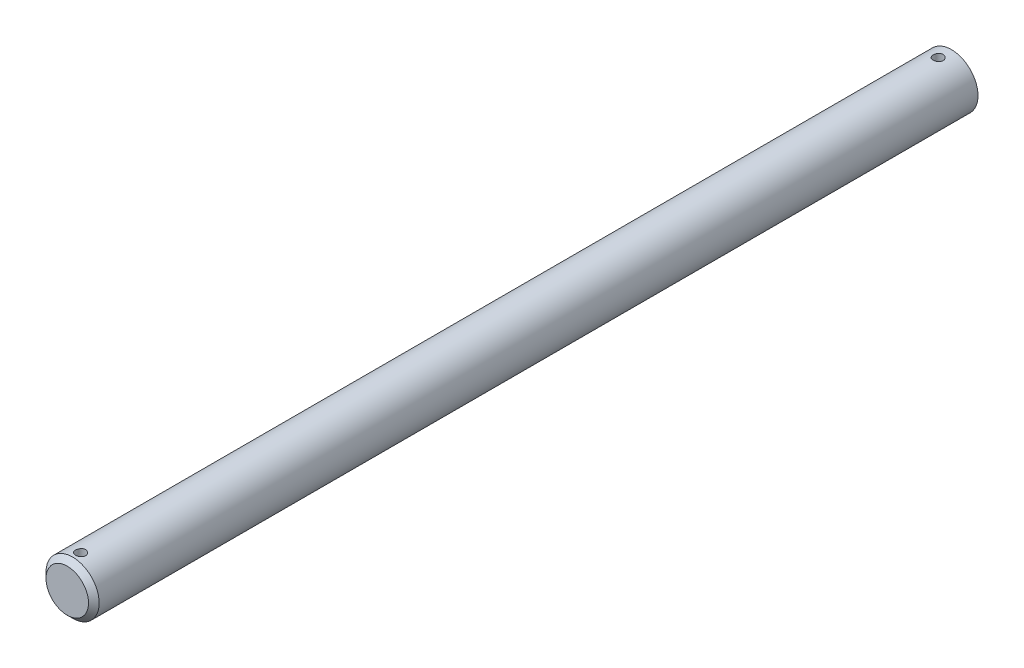
ISO-10303-21;
HEADER;
FILE_DESCRIPTION(('STEP AP214'),'2;1');
FILE_NAME('part.step','',(''),(''),'','','');
FILE_SCHEMA(('AUTOMOTIVE_DESIGN { 1 0 10303 214 1 1 1 1 }'));
ENDSEC;
DATA;
#1=APPLICATION_CONTEXT('core data for automotive mechanical design processes');
#2=APPLICATION_PROTOCOL_DEFINITION('international standard','automotive_design',2000,#1);
#3=PRODUCT_CONTEXT('',#1,'mechanical');
#4=PRODUCT('Part','Part','',(#3));
#5=PRODUCT_RELATED_PRODUCT_CATEGORY('part','',(#4));
#6=PRODUCT_DEFINITION_FORMATION('','',#4);
#7=PRODUCT_DEFINITION_CONTEXT('part definition',#1,'design');
#8=PRODUCT_DEFINITION('design','',#6,#7);
#9=PRODUCT_DEFINITION_SHAPE('','',#8);
#10=(LENGTH_UNIT() NAMED_UNIT(*) SI_UNIT(.MILLI.,.METRE.));
#11=(NAMED_UNIT(*) PLANE_ANGLE_UNIT() SI_UNIT($,.RADIAN.));
#12=(NAMED_UNIT(*) SI_UNIT($,.STERADIAN.) SOLID_ANGLE_UNIT());
#13=UNCERTAINTY_MEASURE_WITH_UNIT(LENGTH_MEASURE(1.E-05),#10,'distance_accuracy_value','');
#14=(GEOMETRIC_REPRESENTATION_CONTEXT(3) GLOBAL_UNCERTAINTY_ASSIGNED_CONTEXT((#13)) GLOBAL_UNIT_ASSIGNED_CONTEXT((#10,
#11,#12)) REPRESENTATION_CONTEXT('',''));
#15=CARTESIAN_POINT('',(0.,0.,0.));
#16=DIRECTION('',(0.,0.,1.));
#17=DIRECTION('',(1.,0.,0.));
#18=AXIS2_PLACEMENT_3D('',#15,#16,#17);
#19=CARTESIAN_POINT('',(0.,0.,304.8));
#20=DIRECTION('',(0.,0.,-1.));
#21=DIRECTION('',(-1.,0.,0.));
#22=AXIS2_PLACEMENT_3D('',#19,#20,#21);
#23=CYLINDRICAL_SURFACE('',#22,3.175);
#24=CARTESIAN_POINT('',(0.,-3.17500000000001,201.355762388));
#25=CARTESIAN_POINT('',(0.0331278493784846,-3.17499940005936,201.355761122132));
#26=CARTESIAN_POINT('',(0.0662721689897596,-3.17447616437681,201.352987804467));
#27=CARTESIAN_POINT('',(0.131626820280966,-3.17243930650301,201.341974952437));
#28=CARTESIAN_POINT('',(0.163836339741667,-3.17092484847488,201.333730804777));
#29=CARTESIAN_POINT('',(0.226366769234935,-3.16707495697542,201.312037597188));
#30=CARTESIAN_POINT('',(0.256689356240746,-3.16474026510011,201.298593237808));
#31=CARTESIAN_POINT('',(0.314645664321683,-3.1595048514429,201.266894583721));
#32=CARTESIAN_POINT('',(0.342279602808188,-3.1566041754851,201.248640678371));
#33=CARTESIAN_POINT('',(0.394407912259922,-3.15051811645857,201.207609042574));
#34=CARTESIAN_POINT('',(0.418865429028264,-3.14733001333615,201.184784889647));
#35=CARTESIAN_POINT('',(0.463627811849752,-3.14104860763278,201.135360512206));
#36=CARTESIAN_POINT('',(0.483932379579181,-3.13795531187579,201.108760016654));
#37=CARTESIAN_POINT('',(0.519965775954873,-3.13218731275362,201.052277596681));
#38=CARTESIAN_POINT('',(0.535657115316881,-3.12951611636079,201.02237136603));
#39=CARTESIAN_POINT('',(0.561778643443755,-3.12493308056008,200.960288787289));
#40=CARTESIAN_POINT('',(0.572209285923862,-3.1230211756692,200.928112635243));
#41=CARTESIAN_POINT('',(0.58739505609202,-3.120200569874,200.862797905731));
#42=CARTESIAN_POINT('',(0.59221445482466,-3.11928051754793,200.829674771297));
#43=CARTESIAN_POINT('',(0.596240425878414,-3.11851356370003,200.763078238404));
#44=CARTESIAN_POINT('',(0.595447501537273,-3.11866656594196,200.729604871624));
#45=CARTESIAN_POINT('',(0.588323450296881,-3.12001809916009,200.66372370141));
#46=CARTESIAN_POINT('',(0.582065407796807,-3.12120283233474,200.631307670137));
#47=CARTESIAN_POINT('',(0.564303860103701,-3.12446266491103,200.567993921399));
#48=CARTESIAN_POINT('',(0.55280013201302,-3.12653780214715,200.537096268513));
#49=CARTESIAN_POINT('',(0.524802287242856,-3.13135905069247,200.477482506022));
#50=CARTESIAN_POINT('',(0.508278659956943,-3.13410911079899,200.448780588738));
#51=CARTESIAN_POINT('',(0.470730932942591,-3.13996773104909,200.394529261361));
#52=CARTESIAN_POINT('',(0.449706376466772,-3.14307632756161,200.368980171626));
#53=CARTESIAN_POINT('',(0.403359563188525,-3.14936188004891,200.321337483717));
#54=CARTESIAN_POINT('',(0.37797479525409,-3.15253914125163,200.299304691558));
#55=CARTESIAN_POINT('',(0.32383731472361,-3.15855900111739,200.259801108107));
#56=CARTESIAN_POINT('',(0.295084568364021,-3.16140159642489,200.242330362555));
#57=CARTESIAN_POINT('',(0.234963886209643,-3.16643757934512,200.212437841933));
#58=CARTESIAN_POINT('',(0.203592733389709,-3.16863015282216,200.200022391288));
#59=CARTESIAN_POINT('',(0.139159898923859,-3.17211275581705,200.180654369804));
#60=CARTESIAN_POINT('',(0.106098397260245,-3.17340288121049,200.173701218644));
#61=CARTESIAN_POINT('',(0.0397464966210265,-3.17492205629787,200.16553980694));
#62=CARTESIAN_POINT('',(0.00646668626416867,-3.17516649268312,200.164248232612));
#63=CARTESIAN_POINT('',(-0.0598333703365886,-3.17460925115548,200.167223156445));
#64=CARTESIAN_POINT('',(-0.0928536292531561,-3.1738076246401,200.171489381529));
#65=CARTESIAN_POINT('',(-0.157432999370983,-3.17125791126725,200.185389536338));
#66=CARTESIAN_POINT('',(-0.189001503602659,-3.16951726067194,200.194981309507));
#67=CARTESIAN_POINT('',(-0.250082300755401,-3.16528387378086,200.219214665378));
#68=CARTESIAN_POINT('',(-0.27959445390493,-3.16279108642312,200.23385659094));
#69=CARTESIAN_POINT('',(-0.336080366506805,-3.157291557982,200.267959020113));
#70=CARTESIAN_POINT('',(-0.363022863065377,-3.1542794982553,200.287470431107));
#71=CARTESIAN_POINT('',(-0.41328114704562,-3.1480892694748,200.330689086266));
#72=CARTESIAN_POINT('',(-0.436596595436346,-3.14491108492986,200.354396722222));
#73=CARTESIAN_POINT('',(-0.479255517992189,-3.13869576292426,200.405712027068));
#74=CARTESIAN_POINT('',(-0.498542136242471,-3.1356610588829,200.433367304662));
#75=CARTESIAN_POINT('',(-0.532196179135592,-3.13012528651481,200.491574070233));
#76=CARTESIAN_POINT('',(-0.546563786592768,-3.12762419835761,200.522125450522));
#77=CARTESIAN_POINT('',(-0.569891360504025,-3.12345793983175,200.585112841562));
#78=CARTESIAN_POINT('',(-0.578877385529314,-3.12178874798387,200.617538923013));
#79=CARTESIAN_POINT('',(-0.591267071076002,-3.11946609009084,200.683474879438));
#80=CARTESIAN_POINT('',(-0.59467136141813,-3.11881250944861,200.716984631701));
#81=CARTESIAN_POINT('',(-0.59577986852629,-3.11860088672157,200.783567194541));
#82=CARTESIAN_POINT('',(-0.593573770795143,-3.11902560714798,200.816638490442));
#83=CARTESIAN_POINT('',(-0.583720477284632,-3.12088450886938,200.881929921124));
#84=CARTESIAN_POINT('',(-0.576073314010795,-3.12231868413375,200.914150060988));
#85=CARTESIAN_POINT('',(-0.555592803846082,-3.126027641217,200.976776324153));
#86=CARTESIAN_POINT('',(-0.542769168607848,-3.12830084823628,201.00718572269));
#87=CARTESIAN_POINT('',(-0.512309542245317,-3.13343285059637,201.065435726402));
#88=CARTESIAN_POINT('',(-0.494673211138125,-3.13629168730423,201.09327614991));
#89=CARTESIAN_POINT('',(-0.454777027878794,-3.14232633736512,201.146047161017));
#90=CARTESIAN_POINT('',(-0.432451906336462,-3.1455062556199,201.170927942363));
#91=CARTESIAN_POINT('',(-0.38394795842585,-3.15179405961499,201.216620061853));
#92=CARTESIAN_POINT('',(-0.35776824793824,-3.15490192863972,201.237430463827));
#93=CARTESIAN_POINT('',(-0.302015900075398,-3.1607282796232,201.274566109824));
#94=CARTESIAN_POINT('',(-0.272414837535445,-3.1634430039313,201.290849286182));
#95=CARTESIAN_POINT('',(-0.210855763856349,-3.16814048941711,201.318185325028));
#96=CARTESIAN_POINT('',(-0.178899999270506,-3.17012393770744,201.329243100109));
#97=CARTESIAN_POINT('',(-0.122375296121223,-3.17273102874592,201.34356932216));
#98=CARTESIAN_POINT('',(-0.0981367934437031,-3.17357708754789,201.348133906905));
#99=CARTESIAN_POINT('',(-0.0492685574488244,-3.17471178919249,201.354230872027));
#100=CARTESIAN_POINT('',(-0.0246388340934173,-3.1750004462058,201.355763329489));
#101=CARTESIAN_POINT('',(0.,-3.17500000000001,201.355762388));
#102=B_SPLINE_CURVE_WITH_KNOTS('',3,(#24,#25,#26,#27,#28,#29,#30,#31,#32,#33,#34,#35,#36,#37,
#38,#39,#40,#41,#42,#43,#44,#45,#46,#47,#48,#49,#50,#51,#52,#53,#54,#55,#56,#57,#58,#59,#60,#61,
#62,#63,#64,#65,#66,#67,#68,#69,#70,#71,#72,#73,#74,#75,#76,#77,#78,#79,#80,#81,#82,#83,#84,#85,
#86,#87,#88,#89,#90,#91,#92,#93,#94,#95,#96,#97,#98,#99,#100,#101),.UNSPECIFIED.,.T.,.F.,(4,2,2,
2,2,2,2,2,2,2,2,2,2,2,2,2,2,2,2,2,2,2,2,2,2,2,2,2,2,2,2,2,2,2,2,2,2,2,4),(0.,0.0992934422579583,
0.198670720631257,0.297958379519771,0.397238003055782,0.497582499616605,0.597934201813104,
0.699080193564199,0.800217460363048,0.900184538548679,1.00014265136194,1.09878415868192,
1.19742985782943,1.29666707356096,1.39591436451039,1.4967258310918,1.59753830838151,
1.69847652240176,1.79940401117395,1.89884119086453,1.99827348496883,2.09692967832171,
2.19559257087284,2.29533361900779,2.3950839846395,2.49615895304336,2.59723016460248,
2.69780792915494,2.79837434413151,2.89734328229479,2.99631162921164,3.09509515682431,
3.19388566460123,3.2941552495541,3.39444786907212,3.49564344413668,3.59674369125814,
3.67059505483129,3.74444454087571),.UNSPECIFIED.);
#103=CARTESIAN_POINT('',(0.,-3.17500000000001,201.355762388));
#104=VERTEX_POINT('',#103);
#105=EDGE_CURVE('E10',#104,#104,#102,.T.);
#106=ORIENTED_EDGE('',*,*,#105,.T.);
#107=EDGE_LOOP('',(#106));
#108=FACE_BOUND('',#107,.T.);
#109=CARTESIAN_POINT('',(0.,3.17499999999999,201.355762388));
#110=CARTESIAN_POINT('',(-0.0331278493784855,3.17499940005934,201.355761122132));
#111=CARTESIAN_POINT('',(-0.0662721689897605,3.1744761643768,201.352987804467));
#112=CARTESIAN_POINT('',(-0.131626820280967,3.17243930650299,201.341974952437));
#113=CARTESIAN_POINT('',(-0.163836339741668,3.17092484847486,201.333730804777));
#114=CARTESIAN_POINT('',(-0.226366769234936,3.1670749569754,201.312037597188));
#115=CARTESIAN_POINT('',(-0.256689356240747,3.16474026510009,201.298593237808));
#116=CARTESIAN_POINT('',(-0.314645664321684,3.15950485144288,201.266894583721));
#117=CARTESIAN_POINT('',(-0.342279602808189,3.15660417548508,201.248640678371));
#118=CARTESIAN_POINT('',(-0.394407912259923,3.15051811645855,201.207609042574));
#119=CARTESIAN_POINT('',(-0.418865429028265,3.14733001333613,201.184784889647));
#120=CARTESIAN_POINT('',(-0.463627811849753,3.14104860763276,201.135360512206));
#121=CARTESIAN_POINT('',(-0.483932379579183,3.13795531187577,201.108760016654));
#122=CARTESIAN_POINT('',(-0.519965775954879,3.1321873127536,201.052277596681));
#123=CARTESIAN_POINT('',(-0.53565711531689,3.12951611636077,201.02237136603));
#124=CARTESIAN_POINT('',(-0.561778643443761,3.12493308056006,200.960288787289));
#125=CARTESIAN_POINT('',(-0.572209285923865,3.12302117566918,200.928112635243));
#126=CARTESIAN_POINT('',(-0.587395056092021,3.12020056987398,200.862797905731));
#127=CARTESIAN_POINT('',(-0.592214454824661,3.11928051754791,200.829674771297));
#128=CARTESIAN_POINT('',(-0.596240425878414,3.11851356370001,200.763078238404));
#129=CARTESIAN_POINT('',(-0.595447501537274,3.11866656594194,200.729604871624));
#130=CARTESIAN_POINT('',(-0.588323450296882,3.12001809916007,200.66372370141));
#131=CARTESIAN_POINT('',(-0.582065407796808,3.12120283233472,200.631307670137));
#132=CARTESIAN_POINT('',(-0.564303860103702,3.12446266491101,200.567993921399));
#133=CARTESIAN_POINT('',(-0.552800132013022,3.12653780214713,200.537096268513));
#134=CARTESIAN_POINT('',(-0.52480228724286,3.13135905069245,200.477482506022));
#135=CARTESIAN_POINT('',(-0.50827865995695,3.13410911079897,200.448780588738));
#136=CARTESIAN_POINT('',(-0.470730932942601,3.13996773104907,200.394529261361));
#137=CARTESIAN_POINT('',(-0.449706376466779,3.14307632756159,200.368980171626));
#138=CARTESIAN_POINT('',(-0.403359563188527,3.14936188004889,200.321337483717));
#139=CARTESIAN_POINT('',(-0.377974795254091,3.15253914125161,200.299304691558));
#140=CARTESIAN_POINT('',(-0.323837314723611,3.15855900111738,200.259801108107));
#141=CARTESIAN_POINT('',(-0.295084568364021,3.16140159642487,200.242330362555));
#142=CARTESIAN_POINT('',(-0.234963886209644,3.1664375793451,200.212437841933));
#143=CARTESIAN_POINT('',(-0.203592733389709,3.16863015282214,200.200022391288));
#144=CARTESIAN_POINT('',(-0.139159898923859,3.17211275581703,200.180654369804));
#145=CARTESIAN_POINT('',(-0.106098397260245,3.17340288121047,200.173701218644));
#146=CARTESIAN_POINT('',(-0.0397464966210274,3.17492205629785,200.16553980694));
#147=CARTESIAN_POINT('',(-0.00646668626416959,3.1751664926831,200.164248232612));
#148=CARTESIAN_POINT('',(0.0598333703365877,3.17460925115546,200.167223156445));
#149=CARTESIAN_POINT('',(0.0928536292531552,3.17380762464008,200.171489381529));
#150=CARTESIAN_POINT('',(0.157432999370982,3.17125791126723,200.185389536338));
#151=CARTESIAN_POINT('',(0.189001503602658,3.16951726067192,200.194981309507));
#152=CARTESIAN_POINT('',(0.2500823007554,3.16528387378084,200.219214665378));
#153=CARTESIAN_POINT('',(0.279594453904929,3.1627910864231,200.23385659094));
#154=CARTESIAN_POINT('',(0.336080366506804,3.15729155798198,200.267959020113));
#155=CARTESIAN_POINT('',(0.363022863065377,3.15427949825529,200.287470431107));
#156=CARTESIAN_POINT('',(0.413281147045619,3.14808926947478,200.330689086266));
#157=CARTESIAN_POINT('',(0.436596595436346,3.14491108492984,200.354396722222));
#158=CARTESIAN_POINT('',(0.479255517992188,3.13869576292425,200.405712027068));
#159=CARTESIAN_POINT('',(0.49854213624247,3.13566105888289,200.433367304662));
#160=CARTESIAN_POINT('',(0.532196179135591,3.13012528651479,200.491574070233));
#161=CARTESIAN_POINT('',(0.546563786592767,3.1276241983576,200.522125450522));
#162=CARTESIAN_POINT('',(0.569891360504024,3.12345793983173,200.585112841562));
#163=CARTESIAN_POINT('',(0.578877385529313,3.12178874798385,200.617538923013));
#164=CARTESIAN_POINT('',(0.591267071076001,3.11946609009083,200.683474879438));
#165=CARTESIAN_POINT('',(0.594671361418129,3.11881250944859,200.716984631701));
#166=CARTESIAN_POINT('',(0.595779868526289,3.11860088672155,200.783567194541));
#167=CARTESIAN_POINT('',(0.593573770795142,3.11902560714797,200.816638490442));
#168=CARTESIAN_POINT('',(0.583720477284631,3.12088450886936,200.881929921124));
#169=CARTESIAN_POINT('',(0.576073314010794,3.12231868413373,200.914150060988));
#170=CARTESIAN_POINT('',(0.555592803846081,3.12602764121698,200.976776324153));
#171=CARTESIAN_POINT('',(0.542769168607848,3.12830084823626,201.00718572269));
#172=CARTESIAN_POINT('',(0.512309542245316,3.13343285059635,201.065435726402));
#173=CARTESIAN_POINT('',(0.494673211138124,3.13629168730421,201.09327614991));
#174=CARTESIAN_POINT('',(0.454777027878793,3.1423263373651,201.146047161017));
#175=CARTESIAN_POINT('',(0.432451906336461,3.14550625561988,201.170927942363));
#176=CARTESIAN_POINT('',(0.383947958425849,3.15179405961497,201.216620061853));
#177=CARTESIAN_POINT('',(0.357768247938239,3.1549019286397,201.237430463827));
#178=CARTESIAN_POINT('',(0.3020159000754,3.16072827962318,201.274566109824));
#179=CARTESIAN_POINT('',(0.272414837535451,3.16344300393128,201.290849286182));
#180=CARTESIAN_POINT('',(0.210855763856355,3.16814048941709,201.318185325028));
#181=CARTESIAN_POINT('',(0.178899999270508,3.17012393770742,201.329243100109));
#182=CARTESIAN_POINT('',(0.122375296121221,3.17273102874591,201.34356932216));
#183=CARTESIAN_POINT('',(0.0981367934437021,3.17357708754787,201.348133906905));
#184=CARTESIAN_POINT('',(0.0492685574488235,3.17471178919247,201.354230872027));
#185=CARTESIAN_POINT('',(0.0246388340934163,3.17500044620578,201.355763329489));
#186=CARTESIAN_POINT('',(0.,3.17499999999999,201.355762388));
#187=B_SPLINE_CURVE_WITH_KNOTS('',3,(#109,#110,#111,#112,#113,#114,#115,#116,#117,#118,#119,
#120,#121,#122,#123,#124,#125,#126,#127,#128,#129,#130,#131,#132,#133,#134,#135,#136,#137,#138,
#139,#140,#141,#142,#143,#144,#145,#146,#147,#148,#149,#150,#151,#152,#153,#154,#155,#156,#157,
#158,#159,#160,#161,#162,#163,#164,#165,#166,#167,#168,#169,#170,#171,#172,#173,#174,#175,#176,
#177,#178,#179,#180,#181,#182,#183,#184,#185,#186),.UNSPECIFIED.,.T.,.F.,(4,2,2,2,2,2,2,2,2,2,2,
2,2,2,2,2,2,2,2,2,2,2,2,2,2,2,2,2,2,2,2,2,2,2,2,2,2,2,4),(0.,0.0992934422579583,
0.198670720631257,0.297958379519771,0.397238003055782,0.497582499616605,0.597934201813104,
0.699080193564228,0.800217460363047,0.900184538548678,1.00014265136194,1.09878415868192,
1.19742985782943,1.29666707356093,1.39591436451039,1.4967258310918,1.59753830838151,
1.69847652240176,1.79940401117395,1.89884119086453,1.99827348496883,2.09692967832171,
2.19559257087283,2.29533361900779,2.39508398463949,2.49615895304335,2.59723016460247,
2.69780792915493,2.79837434413151,2.89734328229479,2.99631162921164,3.09509515682431,
3.19388566460123,3.2941552495541,3.39444786907212,3.49564344413667,3.59674369125814,
3.67059505483129,3.74444454087571),.UNSPECIFIED.);
#188=CARTESIAN_POINT('',(0.,3.17499999999999,201.355762388));
#189=VERTEX_POINT('',#188);
#190=EDGE_CURVE('E45',#189,#189,#187,.T.);
#191=ORIENTED_EDGE('',*,*,#190,.T.);
#192=EDGE_LOOP('',(#191));
#193=FACE_BOUND('',#192,.T.);
#194=CARTESIAN_POINT('',(0.,-3.17500000000001,303.8078125));
#195=CARTESIAN_POINT('',(0.0331278493784956,-3.17499940005936,303.807811234132));
#196=CARTESIAN_POINT('',(0.0662721689897699,-3.17447616437681,303.805037916467));
#197=CARTESIAN_POINT('',(0.131626820280976,-3.17243930650301,303.794025064437));
#198=CARTESIAN_POINT('',(0.163836339741677,-3.17092484847488,303.785780916777));
#199=CARTESIAN_POINT('',(0.226366769234958,-3.16707495697542,303.764087709188));
#200=CARTESIAN_POINT('',(0.256689356240781,-3.16474026510011,303.750643349808));
#201=CARTESIAN_POINT('',(0.314645664321714,-3.15950485144289,303.718944695721));
#202=CARTESIAN_POINT('',(0.342279602808203,-3.15660417548509,303.700690790371));
#203=CARTESIAN_POINT('',(0.394407912259931,-3.15051811645857,303.659659154574));
#204=CARTESIAN_POINT('',(0.41886542902828,-3.14733001333615,303.636835001646));
#205=CARTESIAN_POINT('',(0.463627811849776,-3.14104860763277,303.587410624206));
#206=CARTESIAN_POINT('',(0.483932379579207,-3.13795531187578,303.560810128654));
#207=CARTESIAN_POINT('',(0.519965775954901,-3.13218731275362,303.504327708681));
#208=CARTESIAN_POINT('',(0.535657115316909,-3.12951611636079,303.47442147803));
#209=CARTESIAN_POINT('',(0.561778643443776,-3.12493308056008,303.412338899289));
#210=CARTESIAN_POINT('',(0.572209285923881,-3.1230211756692,303.380162747243));
#211=CARTESIAN_POINT('',(0.587395056092034,-3.120200569874,303.314848017731));
#212=CARTESIAN_POINT('',(0.592214454824669,-3.11928051754792,303.281724883297));
#213=CARTESIAN_POINT('',(0.596240425878417,-3.11851356370003,303.215128350404));
#214=CARTESIAN_POINT('',(0.595447501537278,-3.11866656594196,303.181654983624));
#215=CARTESIAN_POINT('',(0.58832345029689,-3.12001809916009,303.11577381341));
#216=CARTESIAN_POINT('',(0.582065407796815,-3.12120283233474,303.083357782137));
#217=CARTESIAN_POINT('',(0.564303860103707,-3.12446266491103,303.020044033399));
#218=CARTESIAN_POINT('',(0.552800132013023,-3.12653780214715,302.989146380513));
#219=CARTESIAN_POINT('',(0.524802287242861,-3.13135905069247,302.929532618022));
#220=CARTESIAN_POINT('',(0.508278659956958,-3.13410911079899,302.900830700738));
#221=CARTESIAN_POINT('',(0.470730932942623,-3.13996773104909,302.846579373361));
#222=CARTESIAN_POINT('',(0.449706376466809,-3.14307632756161,302.821030283626));
#223=CARTESIAN_POINT('',(0.403359563188558,-3.14936188004891,302.773387595718));
#224=CARTESIAN_POINT('',(0.377974795254109,-3.15253914125163,302.751354803558));
#225=CARTESIAN_POINT('',(0.323837314723599,-3.1585590011174,302.711851220107));
#226=CARTESIAN_POINT('',(0.295084568363997,-3.16140159642489,302.694380474555));
#227=CARTESIAN_POINT('',(0.234963886209613,-3.16643757934512,302.664487953933));
#228=CARTESIAN_POINT('',(0.203592733389688,-3.16863015282216,302.652072503288));
#229=CARTESIAN_POINT('',(0.139159898923856,-3.17211275581705,302.632704481804));
#230=CARTESIAN_POINT('',(0.106098397260251,-3.17340288121049,302.625751330645));
#231=CARTESIAN_POINT('',(0.0397464966210445,-3.17492205629787,302.61758991894));
#232=CARTESIAN_POINT('',(0.00646668626418795,-3.17516649268312,302.616298344612));
#233=CARTESIAN_POINT('',(-0.0598333703365708,-3.17460925115548,302.619273268446));
#234=CARTESIAN_POINT('',(-0.0928536292531409,-3.1738076246401,302.623539493529));
#235=CARTESIAN_POINT('',(-0.157432999370963,-3.17125791126725,302.637439648338));
#236=CARTESIAN_POINT('',(-0.189001503602631,-3.16951726067195,302.647031421507));
#237=CARTESIAN_POINT('',(-0.250082300755378,-3.16528387378086,302.671264777378));
#238=CARTESIAN_POINT('',(-0.279594453904919,-3.16279108642312,302.68590670294));
#239=CARTESIAN_POINT('',(-0.33608036650679,-3.157291557982,302.720009132113));
#240=CARTESIAN_POINT('',(-0.363022863065345,-3.15427949825531,302.739520543107));
#241=CARTESIAN_POINT('',(-0.413281147045584,-3.14808926947481,302.782739198266));
#242=CARTESIAN_POINT('',(-0.436596595436325,-3.14491108492986,302.806446834222));
#243=CARTESIAN_POINT('',(-0.479255517992183,-3.13869576292427,302.857762139068));
#244=CARTESIAN_POINT('',(-0.498542136242465,-3.13566105888291,302.885417416662));
#245=CARTESIAN_POINT('',(-0.532196179135576,-3.13012528651481,302.943624182233));
#246=CARTESIAN_POINT('',(-0.546563786592745,-3.12762419835762,302.974175562522));
#247=CARTESIAN_POINT('',(-0.569891360503998,-3.12345793983176,303.037162953562));
#248=CARTESIAN_POINT('',(-0.578877385529289,-3.12178874798387,303.069589035013));
#249=CARTESIAN_POINT('',(-0.591267071075983,-3.11946609009085,303.135524991438));
#250=CARTESIAN_POINT('',(-0.594671361418111,-3.11881250944861,303.169034743701));
#251=CARTESIAN_POINT('',(-0.595779868526272,-3.11860088672157,303.235617306541));
#252=CARTESIAN_POINT('',(-0.593573770795127,-3.11902560714799,303.268688602442));
#253=CARTESIAN_POINT('',(-0.583720477284618,-3.12088450886938,303.333980033124));
#254=CARTESIAN_POINT('',(-0.57607331401078,-3.12231868413375,303.366200172988));
#255=CARTESIAN_POINT('',(-0.555592803846065,-3.12602764121701,303.428826436153));
#256=CARTESIAN_POINT('',(-0.542769168607834,-3.12830084823628,303.45923583469));
#257=CARTESIAN_POINT('',(-0.512309542245301,-3.13343285059638,303.517485838402));
#258=CARTESIAN_POINT('',(-0.4946732111381,-3.13629168730423,303.54532626191));
#259=CARTESIAN_POINT('',(-0.454777027878766,-3.14232633736512,303.598097273017));
#260=CARTESIAN_POINT('',(-0.432451906336444,-3.1455062556199,303.622978054363));
#261=CARTESIAN_POINT('',(-0.383947958425829,-3.15179405961499,303.668670173853));
#262=CARTESIAN_POINT('',(-0.357768247938207,-3.15490192863972,303.689480575826));
#263=CARTESIAN_POINT('',(-0.302015900075373,-3.16072827962321,303.726616221824));
#264=CARTESIAN_POINT('',(-0.272414837535442,-3.1634430039313,303.742899398182));
#265=CARTESIAN_POINT('',(-0.21085576385636,-3.16814048941711,303.770235437028));
#266=CARTESIAN_POINT('',(-0.178899999270509,-3.17012393770744,303.781293212109));
#267=CARTESIAN_POINT('',(-0.122375296121215,-3.17273102874592,303.79561943416));
#268=CARTESIAN_POINT('',(-0.0981367934436929,-3.17357708754789,303.800184018905));
#269=CARTESIAN_POINT('',(-0.0492685574488116,-3.17471178919249,303.806280984027));
#270=CARTESIAN_POINT('',(-0.0246388340934046,-3.1750004462058,303.807813441489));
#271=CARTESIAN_POINT('',(0.,-3.17500000000001,303.8078125));
#272=B_SPLINE_CURVE_WITH_KNOTS('',3,(#194,#195,#196,#197,#198,#199,#200,#201,#202,#203,#204,
#205,#206,#207,#208,#209,#210,#211,#212,#213,#214,#215,#216,#217,#218,#219,#220,#221,#222,#223,
#224,#225,#226,#227,#228,#229,#230,#231,#232,#233,#234,#235,#236,#237,#238,#239,#240,#241,#242,
#243,#244,#245,#246,#247,#248,#249,#250,#251,#252,#253,#254,#255,#256,#257,#258,#259,#260,#261,
#262,#263,#264,#265,#266,#267,#268,#269,#270,#271),.UNSPECIFIED.,.T.,.F.,(4,2,2,2,2,2,2,2,2,2,2,
2,2,2,2,2,2,2,2,2,2,2,2,2,2,2,2,2,2,2,2,2,2,2,2,2,2,2,4),(0.,0.0992934422579537,
0.198670720631256,0.297958379519797,0.397238003055775,0.497582499616633,0.597934201813132,
0.699080193564254,0.800217460363045,0.900184538548675,1.00014265136191,1.09878415868192,
1.19742985782948,1.29666707356095,1.39591436451032,1.49672583109181,1.59753830838155,
1.69847652240177,1.79940401117393,1.89884119086451,1.99827348496881,2.09692967832168,
2.1955925708728,2.29533361900778,2.39508398463947,2.49615895304333,2.59723016460242,
2.69780792915486,2.79837434413146,2.89734328229474,2.99631162921161,3.09509515682426,
3.19388566460124,3.29415524955408,3.39444786907209,3.49564344413663,3.5967436912581,
3.67059505483126,3.74444454087568),.UNSPECIFIED.);
#273=CARTESIAN_POINT('',(0.,-3.17500000000001,303.8078125));
#274=VERTEX_POINT('',#273);
#275=EDGE_CURVE('E49',#274,#274,#272,.T.);
#276=ORIENTED_EDGE('',*,*,#275,.T.);
#277=EDGE_LOOP('',(#276));
#278=FACE_BOUND('',#277,.T.);
#279=CARTESIAN_POINT('',(0.,3.17499999999999,303.8078125));
#280=CARTESIAN_POINT('',(-0.0331278493784698,3.17499940005934,303.807811234132));
#281=CARTESIAN_POINT('',(-0.0662721689897442,3.17447616437679,303.805037916467));
#282=CARTESIAN_POINT('',(-0.13162682028095,3.17243930650299,303.794025064437));
#283=CARTESIAN_POINT('',(-0.163836339741651,3.17092484847486,303.785780916777));
#284=CARTESIAN_POINT('',(-0.226366769234933,3.1670749569754,303.764087709188));
#285=CARTESIAN_POINT('',(-0.256689356240756,3.16474026510009,303.750643349808));
#286=CARTESIAN_POINT('',(-0.314645664321688,3.15950485144288,303.718944695721));
#287=CARTESIAN_POINT('',(-0.342279602808177,3.15660417548508,303.700690790371));
#288=CARTESIAN_POINT('',(-0.394407912259905,3.15051811645856,303.659659154574));
#289=CARTESIAN_POINT('',(-0.418865429028254,3.14733001333614,303.636835001646));
#290=CARTESIAN_POINT('',(-0.46362781184975,3.14104860763276,303.587410624206));
#291=CARTESIAN_POINT('',(-0.483932379579181,3.13795531187577,303.560810128654));
#292=CARTESIAN_POINT('',(-0.519965775954875,3.1321873127536,303.504327708681));
#293=CARTESIAN_POINT('',(-0.535657115316883,3.12951611636077,303.47442147803));
#294=CARTESIAN_POINT('',(-0.56177864344375,3.12493308056007,303.412338899289));
#295=CARTESIAN_POINT('',(-0.572209285923855,3.12302117566919,303.380162747243));
#296=CARTESIAN_POINT('',(-0.587395056092009,3.12020056987399,303.314848017731));
#297=CARTESIAN_POINT('',(-0.592214454824643,3.11928051754791,303.281724883297));
#298=CARTESIAN_POINT('',(-0.596240425878392,3.11851356370001,303.215128350404));
#299=CARTESIAN_POINT('',(-0.595447501537253,3.11866656594195,303.181654983624));
#300=CARTESIAN_POINT('',(-0.588323450296865,3.12001809916008,303.11577381341));
#301=CARTESIAN_POINT('',(-0.58206540779679,3.12120283233473,303.083357782137));
#302=CARTESIAN_POINT('',(-0.564303860103681,3.12446266491101,303.020044033399));
#303=CARTESIAN_POINT('',(-0.552800132012997,3.12653780214714,302.989146380513));
#304=CARTESIAN_POINT('',(-0.524802287242835,3.13135905069245,302.929532618022));
#305=CARTESIAN_POINT('',(-0.508278659956932,3.13410911079897,302.900830700738));
#306=CARTESIAN_POINT('',(-0.470730932942597,3.13996773104907,302.846579373361));
#307=CARTESIAN_POINT('',(-0.449706376466783,3.14307632756159,302.821030283626));
#308=CARTESIAN_POINT('',(-0.403359563188532,3.14936188004889,302.773387595718));
#309=CARTESIAN_POINT('',(-0.377974795254083,3.15253914125161,302.751354803558));
#310=CARTESIAN_POINT('',(-0.323837314723573,3.15855900111738,302.711851220107));
#311=CARTESIAN_POINT('',(-0.295084568363971,3.16140159642487,302.694380474555));
#312=CARTESIAN_POINT('',(-0.234963886209588,3.16643757934511,302.664487953933));
#313=CARTESIAN_POINT('',(-0.203592733389662,3.16863015282214,302.652072503288));
#314=CARTESIAN_POINT('',(-0.13915989892383,3.17211275581703,302.632704481804));
#315=CARTESIAN_POINT('',(-0.106098397260226,3.17340288121047,302.625751330645));
#316=CARTESIAN_POINT('',(-0.0397464966210191,3.17492205629785,302.61758991894));
#317=CARTESIAN_POINT('',(-0.00646668626416251,3.1751664926831,302.616298344612));
#318=CARTESIAN_POINT('',(0.0598333703365961,3.17460925115546,302.619273268446));
#319=CARTESIAN_POINT('',(0.0928536292531661,3.17380762464008,302.623539493529));
#320=CARTESIAN_POINT('',(0.157432999370988,3.17125791126723,302.637439648338));
#321=CARTESIAN_POINT('',(0.189001503602656,3.16951726067193,302.647031421507));
#322=CARTESIAN_POINT('',(0.250082300755404,3.16528387378084,302.671264777378));
#323=CARTESIAN_POINT('',(0.279594453904944,3.1627910864231,302.68590670294));
#324=CARTESIAN_POINT('',(0.336080366506815,3.15729155798198,302.720009132113));
#325=CARTESIAN_POINT('',(0.36302286306537,3.15427949825529,302.739520543107));
#326=CARTESIAN_POINT('',(0.413281147045609,3.14808926947478,302.782739198266));
#327=CARTESIAN_POINT('',(0.436596595436351,3.14491108492984,302.806446834222));
#328=CARTESIAN_POINT('',(0.479255517992208,3.13869576292424,302.857762139068));
#329=CARTESIAN_POINT('',(0.49854213624249,3.13566105888288,302.885417416662));
#330=CARTESIAN_POINT('',(0.532196179135601,3.13012528651479,302.943624182233));
#331=CARTESIAN_POINT('',(0.54656378659277,3.1276241983576,302.974175562522));
#332=CARTESIAN_POINT('',(0.569891360504023,3.12345793983173,303.037162953562));
#333=CARTESIAN_POINT('',(0.578877385529315,3.12178874798385,303.069589035013));
#334=CARTESIAN_POINT('',(0.591267071076009,3.11946609009082,303.135524991438));
#335=CARTESIAN_POINT('',(0.594671361418136,3.11881250944859,303.169034743701));
#336=CARTESIAN_POINT('',(0.595779868526297,3.11860088672155,303.235617306541));
#337=CARTESIAN_POINT('',(0.593573770795153,3.11902560714796,303.268688602442));
#338=CARTESIAN_POINT('',(0.583720477284644,3.12088450886935,303.333980033124));
#339=CARTESIAN_POINT('',(0.576073314010806,3.12231868413373,303.366200172988));
#340=CARTESIAN_POINT('',(0.555592803846091,3.12602764121698,303.428826436153));
#341=CARTESIAN_POINT('',(0.54276916860786,3.12830084823626,303.45923583469));
#342=CARTESIAN_POINT('',(0.512309542245326,3.13343285059635,303.517485838402));
#343=CARTESIAN_POINT('',(0.494673211138126,3.13629168730421,303.54532626191));
#344=CARTESIAN_POINT('',(0.454777027878792,3.1423263373651,303.598097273017));
#345=CARTESIAN_POINT('',(0.432451906336469,3.14550625561988,303.622978054363));
#346=CARTESIAN_POINT('',(0.383947958425855,3.15179405961497,303.668670173853));
#347=CARTESIAN_POINT('',(0.357768247938233,3.1549019286397,303.689480575826));
#348=CARTESIAN_POINT('',(0.302015900075392,3.16072827962318,303.726616221824));
#349=CARTESIAN_POINT('',(0.272414837535453,3.16344300393128,303.742899398182));
#350=CARTESIAN_POINT('',(0.210855763856371,3.16814048941709,303.770235437028));
#351=CARTESIAN_POINT('',(0.178899999270528,3.17012393770742,303.781293212109));
#352=CARTESIAN_POINT('',(0.122375296121242,3.1727310287459,303.79561943416));
#353=CARTESIAN_POINT('',(0.0981367934437188,3.17357708754787,303.800184018905));
#354=CARTESIAN_POINT('',(0.0492685574488371,3.17471178919247,303.806280984027));
#355=CARTESIAN_POINT('',(0.0246388340934303,3.17500044620578,303.807813441489));
#356=CARTESIAN_POINT('',(0.,3.17499999999999,303.8078125));
#357=B_SPLINE_CURVE_WITH_KNOTS('',3,(#279,#280,#281,#282,#283,#284,#285,#286,#287,#288,#289,
#290,#291,#292,#293,#294,#295,#296,#297,#298,#299,#300,#301,#302,#303,#304,#305,#306,#307,#308,
#309,#310,#311,#312,#313,#314,#315,#316,#317,#318,#319,#320,#321,#322,#323,#324,#325,#326,#327,
#328,#329,#330,#331,#332,#333,#334,#335,#336,#337,#338,#339,#340,#341,#342,#343,#344,#345,#346,
#347,#348,#349,#350,#351,#352,#353,#354,#355,#356),.UNSPECIFIED.,.T.,.F.,(4,2,2,2,2,2,2,2,2,2,2,
2,2,2,2,2,2,2,2,2,2,2,2,2,2,2,2,2,2,2,2,2,2,2,2,2,2,2,4),(0.,0.0992934422579536,
0.198670720631256,0.297958379519797,0.397238003055775,0.497582499616632,0.597934201813132,
0.699080193564254,0.800217460363045,0.900184538548675,1.00014265136191,1.09878415868192,
1.19742985782948,1.29666707356095,1.39591436451032,1.49672583109181,1.59753830838155,
1.69847652240177,1.79940401117393,1.89884119086451,1.99827348496881,2.09692967832168,
2.1955925708728,2.29533361900778,2.39508398463947,2.49615895304333,2.59723016460242,
2.69780792915486,2.79837434413146,2.89734328229474,2.99631162921161,3.09509515682425,
3.19388566460124,3.29415524955408,3.39444786907209,3.49564344413664,3.5967436912581,
3.67059505483125,3.74444454087568),.UNSPECIFIED.);
#358=CARTESIAN_POINT('',(0.,3.17499999999999,303.8078125));
#359=VERTEX_POINT('',#358);
#360=EDGE_CURVE('E53',#359,#359,#357,.T.);
#361=ORIENTED_EDGE('',*,*,#360,.T.);
#362=EDGE_LOOP('',(#361));
#363=FACE_BOUND('',#362,.T.);
#364=CARTESIAN_POINT('',(0.,0.,199.172949888));
#365=DIRECTION('',(0.,0.,1.));
#366=DIRECTION('',(1.,0.,0.));
#367=AXIS2_PLACEMENT_3D('',#364,#365,#366);
#368=CIRCLE('',#367,3.175);
#369=CARTESIAN_POINT('',(3.175,0.,199.172949888));
#370=VERTEX_POINT('',#369);
#371=EDGE_CURVE('E88',#370,#370,#368,.T.);
#372=ORIENTED_EDGE('',*,*,#371,.T.);
#373=EDGE_LOOP('',(#372));
#374=FACE_BOUND('',#373,.T.);
#375=CARTESIAN_POINT('',(0.,0.,304.165));
#376=DIRECTION('',(0.,0.,1.));
#377=DIRECTION('',(1.,0.,0.));
#378=AXIS2_PLACEMENT_3D('',#375,#376,#377);
#379=CIRCLE('',#378,3.175);
#380=CARTESIAN_POINT('',(3.175,0.,304.165));
#381=VERTEX_POINT('',#380);
#382=EDGE_CURVE('E85',#381,#381,#379,.F.);
#383=ORIENTED_EDGE('',*,*,#382,.T.);
#384=EDGE_LOOP('',(#383));
#385=FACE_BOUND('',#384,.T.);
#386=ADVANCED_FACE('F34',(#108,#193,#278,#363,#374,#385),#23,.T.);
#387=CARTESIAN_POINT('',(0.,0.,304.8));
#388=DIRECTION('',(0.,0.,1.));
#389=DIRECTION('',(1.,0.,0.));
#390=AXIS2_PLACEMENT_3D('',#387,#388,#389);
#391=PLANE('',#390);
#392=CARTESIAN_POINT('',(0.,0.,304.8));
#393=DIRECTION('',(0.,0.,1.));
#394=DIRECTION('',(1.,0.,0.));
#395=AXIS2_PLACEMENT_3D('',#392,#393,#394);
#396=CIRCLE('',#395,2.54000000000021);
#397=CARTESIAN_POINT('',(2.54000000000021,0.,304.8));
#398=VERTEX_POINT('',#397);
#399=EDGE_CURVE('E82',#398,#398,#396,.T.);
#400=ORIENTED_EDGE('',*,*,#399,.T.);
#401=EDGE_LOOP('',(#400));
#402=FACE_BOUND('',#401,.T.);
#403=ADVANCED_FACE('F98',(#402),#391,.T.);
#404=CARTESIAN_POINT('',(0.,0.,304.8));
#405=DIRECTION('',(0.,0.,-1.));
#406=DIRECTION('',(-1.,0.,0.));
#407=AXIS2_PLACEMENT_3D('',#404,#405,#406);
#408=CONICAL_SURFACE('',#407,2.54000000000021,0.785398163397418);
#409=ORIENTED_EDGE('',*,*,#382,.F.);
#410=EDGE_LOOP('',(#409));
#411=FACE_BOUND('',#410,.T.);
#412=ORIENTED_EDGE('',*,*,#399,.F.);
#413=EDGE_LOOP('',(#412));
#414=FACE_BOUND('',#413,.T.);
#415=ADVANCED_FACE('F36',(#411,#414),#408,.T.);
#416=CARTESIAN_POINT('',(0.,0.,199.172949888));
#417=DIRECTION('',(0.,0.,1.));
#418=DIRECTION('',(1.,0.,0.));
#419=AXIS2_PLACEMENT_3D('',#416,#417,#418);
#420=PLANE('',#419);
#421=ORIENTED_EDGE('',*,*,#371,.F.);
#422=EDGE_LOOP('',(#421));
#423=FACE_BOUND('',#422,.T.);
#424=ADVANCED_FACE('F74',(#423),#420,.F.);
#425=CARTESIAN_POINT('',(0.,-3.17500000000001,303.2125));
#426=DIRECTION('',(0.,1.,0.));
#427=DIRECTION('',(0.,0.,1.));
#428=AXIS2_PLACEMENT_3D('',#425,#426,#427);
#429=CYLINDRICAL_SURFACE('',#428,0.595312500000002);
#430=ORIENTED_EDGE('',*,*,#360,.F.);
#431=EDGE_LOOP('',(#430));
#432=FACE_BOUND('',#431,.T.);
#433=ORIENTED_EDGE('',*,*,#275,.F.);
#434=EDGE_LOOP('',(#433));
#435=FACE_BOUND('',#434,.T.);
#436=ADVANCED_FACE('F68',(#432,#435),#429,.F.);
#437=CARTESIAN_POINT('',(0.,-3.17500000000001,200.760449888));
#438=DIRECTION('',(0.,1.,0.));
#439=DIRECTION('',(0.,0.,1.));
#440=AXIS2_PLACEMENT_3D('',#437,#438,#439);
#441=CYLINDRICAL_SURFACE('',#440,0.595312500000007);
#442=ORIENTED_EDGE('',*,*,#190,.F.);
#443=EDGE_LOOP('',(#442));
#444=FACE_BOUND('',#443,.T.);
#445=ORIENTED_EDGE('',*,*,#105,.F.);
#446=EDGE_LOOP('',(#445));
#447=FACE_BOUND('',#446,.T.);
#448=ADVANCED_FACE('F65',(#444,#447),#441,.F.);
#449=CLOSED_SHELL('',(#386,#403,#415,#424,#436,#448));
#450=MANIFOLD_SOLID_BREP('B2',#449);
#451=ADVANCED_BREP_SHAPE_REPRESENTATION('',(#18,#450),#14);
#452=SHAPE_DEFINITION_REPRESENTATION(#9,#451);
ENDSEC;
END-ISO-10303-21;
